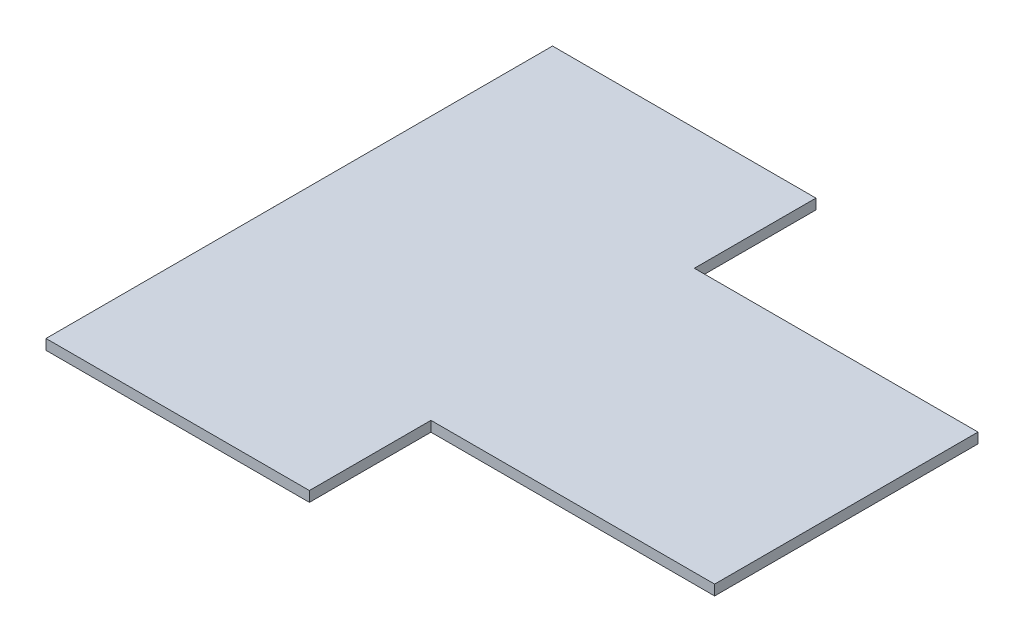
ISO-10303-21;
HEADER;
FILE_DESCRIPTION(('STEP AP214'),'2;1');
FILE_NAME('part.step','',(''),(''),'','','');
FILE_SCHEMA(('AUTOMOTIVE_DESIGN { 1 0 10303 214 1 1 1 1 }'));
ENDSEC;
DATA;
#1=APPLICATION_CONTEXT('core data for automotive mechanical design processes');
#2=APPLICATION_PROTOCOL_DEFINITION('international standard','automotive_design',2000,#1);
#3=PRODUCT_CONTEXT('',#1,'mechanical');
#4=PRODUCT('Part','Part','',(#3));
#5=PRODUCT_RELATED_PRODUCT_CATEGORY('part','',(#4));
#6=PRODUCT_DEFINITION_FORMATION('','',#4);
#7=PRODUCT_DEFINITION_CONTEXT('part definition',#1,'design');
#8=PRODUCT_DEFINITION('design','',#6,#7);
#9=PRODUCT_DEFINITION_SHAPE('','',#8);
#10=(LENGTH_UNIT() NAMED_UNIT(*) SI_UNIT(.MILLI.,.METRE.));
#11=(NAMED_UNIT(*) PLANE_ANGLE_UNIT() SI_UNIT($,.RADIAN.));
#12=(NAMED_UNIT(*) SI_UNIT($,.STERADIAN.) SOLID_ANGLE_UNIT());
#13=UNCERTAINTY_MEASURE_WITH_UNIT(LENGTH_MEASURE(1.E-05),#10,'distance_accuracy_value','');
#14=(GEOMETRIC_REPRESENTATION_CONTEXT(3) GLOBAL_UNCERTAINTY_ASSIGNED_CONTEXT((#13)) GLOBAL_UNIT_ASSIGNED_CONTEXT((#10,
#11,#12)) REPRESENTATION_CONTEXT('',''));
#15=CARTESIAN_POINT('',(0.,0.,0.));
#16=DIRECTION('',(0.,0.,1.));
#17=DIRECTION('',(1.,0.,0.));
#18=AXIS2_PLACEMENT_3D('',#15,#16,#17);
#19=CARTESIAN_POINT('',(-2.50000000000011,1.27,0.));
#20=DIRECTION('',(1.,0.,0.));
#21=DIRECTION('',(0.,0.,-1.));
#22=AXIS2_PLACEMENT_3D('',#19,#20,#21);
#23=PLANE('',#22);
#24=DIRECTION('',(0.,0.,1.));
#25=VECTOR('',#24,1.);
#26=CARTESIAN_POINT('',(-2.50000000000011,-1.27,0.));
#27=LINE('',#26,#25);
#28=CARTESIAN_POINT('',(-2.50000000000005,-1.27,32.5000000000001));
#29=VERTEX_POINT('',#28);
#30=CARTESIAN_POINT('',(-2.50000000000002,-1.27,62.5));
#31=VERTEX_POINT('',#30);
#32=EDGE_CURVE('E131',#29,#31,#27,.T.);
#33=ORIENTED_EDGE('',*,*,#32,.F.);
#34=DIRECTION('',(0.,-1.,0.));
#35=VECTOR('',#34,1.);
#36=CARTESIAN_POINT('',(-2.50000000000005,1.27,32.5000000000001));
#37=LINE('',#36,#35);
#38=CARTESIAN_POINT('',(-2.50000000000005,1.27,32.5000000000001));
#39=VERTEX_POINT('',#38);
#40=EDGE_CURVE('E11',#39,#29,#37,.T.);
#41=ORIENTED_EDGE('',*,*,#40,.F.);
#42=DIRECTION('',(0.,0.,1.));
#43=VECTOR('',#42,1.);
#44=CARTESIAN_POINT('',(-2.50000000000011,1.27,0.));
#45=LINE('',#44,#43);
#46=CARTESIAN_POINT('',(-2.50000000000002,1.27,62.5));
#47=VERTEX_POINT('',#46);
#48=EDGE_CURVE('E149',#39,#47,#45,.T.);
#49=ORIENTED_EDGE('',*,*,#48,.T.);
#50=DIRECTION('',(0.,-1.,0.));
#51=VECTOR('',#50,1.);
#52=CARTESIAN_POINT('',(-2.50000000000002,1.27,62.5));
#53=LINE('',#52,#51);
#54=EDGE_CURVE('E89',#47,#31,#53,.T.);
#55=ORIENTED_EDGE('',*,*,#54,.T.);
#56=EDGE_LOOP('',(#33,#41,#49,#55));
#57=FACE_BOUND('',#56,.T.);
#58=ADVANCED_FACE('F39',(#57),#23,.T.);
#59=CARTESIAN_POINT('',(0.,1.27,32.5000000000001));
#60=DIRECTION('',(0.,0.,1.));
#61=DIRECTION('',(1.,0.,0.));
#62=AXIS2_PLACEMENT_3D('',#59,#60,#61);
#63=PLANE('',#62);
#64=DIRECTION('',(-1.,0.,0.));
#65=VECTOR('',#64,1.);
#66=CARTESIAN_POINT('',(0.,-1.27,32.5000000000001));
#67=LINE('',#66,#65);
#68=CARTESIAN_POINT('',(67.5,-1.27,32.5000000000001));
#69=VERTEX_POINT('',#68);
#70=EDGE_CURVE('E134',#69,#29,#67,.T.);
#71=ORIENTED_EDGE('',*,*,#70,.F.);
#72=DIRECTION('',(0.,-1.,0.));
#73=VECTOR('',#72,1.);
#74=CARTESIAN_POINT('',(67.5,1.27,32.5000000000001));
#75=LINE('',#74,#73);
#76=CARTESIAN_POINT('',(67.5,1.27,32.5000000000001));
#77=VERTEX_POINT('',#76);
#78=EDGE_CURVE('E47',#77,#69,#75,.T.);
#79=ORIENTED_EDGE('',*,*,#78,.F.);
#80=DIRECTION('',(-1.,0.,0.));
#81=VECTOR('',#80,1.);
#82=CARTESIAN_POINT('',(0.,1.27,32.5000000000001));
#83=LINE('',#82,#81);
#84=EDGE_CURVE('E173',#77,#39,#83,.T.);
#85=ORIENTED_EDGE('',*,*,#84,.T.);
#86=ORIENTED_EDGE('',*,*,#40,.T.);
#87=EDGE_LOOP('',(#71,#79,#85,#86));
#88=FACE_BOUND('',#87,.T.);
#89=ADVANCED_FACE('F172',(#88),#63,.T.);
#90=CARTESIAN_POINT('',(67.5,1.27,0.));
#91=DIRECTION('',(-1.,0.,0.));
#92=DIRECTION('',(0.,0.,1.));
#93=AXIS2_PLACEMENT_3D('',#90,#91,#92);
#94=PLANE('',#93);
#95=DIRECTION('',(0.,0.,-1.));
#96=VECTOR('',#95,1.);
#97=CARTESIAN_POINT('',(67.5,-1.27,0.));
#98=LINE('',#97,#96);
#99=CARTESIAN_POINT('',(67.5,-1.27,-32.4999999999999));
#100=VERTEX_POINT('',#99);
#101=EDGE_CURVE('E137',#69,#100,#98,.T.);
#102=ORIENTED_EDGE('',*,*,#101,.T.);
#103=DIRECTION('',(0.,-1.,0.));
#104=VECTOR('',#103,1.);
#105=CARTESIAN_POINT('',(67.5,1.27,-32.4999999999999));
#106=LINE('',#105,#104);
#107=CARTESIAN_POINT('',(67.5,1.27,-32.4999999999999));
#108=VERTEX_POINT('',#107);
#109=EDGE_CURVE('E156',#108,#100,#106,.T.);
#110=ORIENTED_EDGE('',*,*,#109,.F.);
#111=DIRECTION('',(0.,0.,-1.));
#112=VECTOR('',#111,1.);
#113=CARTESIAN_POINT('',(67.5,1.27,0.));
#114=LINE('',#113,#112);
#115=EDGE_CURVE('E163',#77,#108,#114,.T.);
#116=ORIENTED_EDGE('',*,*,#115,.F.);
#117=ORIENTED_EDGE('',*,*,#78,.T.);
#118=EDGE_LOOP('',(#102,#110,#116,#117));
#119=FACE_BOUND('',#118,.T.);
#120=ADVANCED_FACE('F161',(#119),#94,.F.);
#121=CARTESIAN_POINT('',(0.,1.27,-32.4999999999999));
#122=DIRECTION('',(0.,0.,1.));
#123=DIRECTION('',(1.,0.,0.));
#124=AXIS2_PLACEMENT_3D('',#121,#122,#123);
#125=PLANE('',#124);
#126=DIRECTION('',(-1.,0.,0.));
#127=VECTOR('',#126,1.);
#128=CARTESIAN_POINT('',(0.,-1.27,-32.4999999999999));
#129=LINE('',#128,#127);
#130=CARTESIAN_POINT('',(-2.50000000000005,-1.27,-32.4999999999999));
#131=VERTEX_POINT('',#130);
#132=EDGE_CURVE('E139',#100,#131,#129,.T.);
#133=ORIENTED_EDGE('',*,*,#132,.T.);
#134=DIRECTION('',(0.,-1.,0.));
#135=VECTOR('',#134,1.);
#136=CARTESIAN_POINT('',(-2.50000000000005,1.27,-32.4999999999999));
#137=LINE('',#136,#135);
#138=CARTESIAN_POINT('',(-2.50000000000005,1.27,-32.4999999999999));
#139=VERTEX_POINT('',#138);
#140=EDGE_CURVE('E153',#139,#131,#137,.T.);
#141=ORIENTED_EDGE('',*,*,#140,.F.);
#142=DIRECTION('',(-1.,0.,0.));
#143=VECTOR('',#142,1.);
#144=CARTESIAN_POINT('',(0.,1.27,-32.4999999999999));
#145=LINE('',#144,#143);
#146=EDGE_CURVE('E179',#108,#139,#145,.T.);
#147=ORIENTED_EDGE('',*,*,#146,.F.);
#148=ORIENTED_EDGE('',*,*,#109,.T.);
#149=EDGE_LOOP('',(#133,#141,#147,#148));
#150=FACE_BOUND('',#149,.T.);
#151=ADVANCED_FACE('F183',(#150),#125,.F.);
#152=CARTESIAN_POINT('',(-2.50000000000011,1.27,0.));
#153=DIRECTION('',(-1.,0.,0.));
#154=DIRECTION('',(0.,0.,1.));
#155=AXIS2_PLACEMENT_3D('',#152,#153,#154);
#156=PLANE('',#155);
#157=DIRECTION('',(0.,0.,-1.));
#158=VECTOR('',#157,1.);
#159=CARTESIAN_POINT('',(-2.50000000000011,-1.27,0.));
#160=LINE('',#159,#158);
#161=CARTESIAN_POINT('',(-2.50000000000002,-1.27,-62.5));
#162=VERTEX_POINT('',#161);
#163=EDGE_CURVE('E141',#131,#162,#160,.T.);
#164=ORIENTED_EDGE('',*,*,#163,.T.);
#165=DIRECTION('',(0.,-1.,0.));
#166=VECTOR('',#165,1.);
#167=CARTESIAN_POINT('',(-2.50000000000002,1.27,-62.5));
#168=LINE('',#167,#166);
#169=CARTESIAN_POINT('',(-2.50000000000002,1.27,-62.5));
#170=VERTEX_POINT('',#169);
#171=EDGE_CURVE('E118',#170,#162,#168,.T.);
#172=ORIENTED_EDGE('',*,*,#171,.F.);
#173=DIRECTION('',(0.,0.,-1.));
#174=VECTOR('',#173,1.);
#175=CARTESIAN_POINT('',(-2.50000000000011,1.27,0.));
#176=LINE('',#175,#174);
#177=EDGE_CURVE('E123',#139,#170,#176,.T.);
#178=ORIENTED_EDGE('',*,*,#177,.F.);
#179=ORIENTED_EDGE('',*,*,#140,.T.);
#180=EDGE_LOOP('',(#164,#172,#178,#179));
#181=FACE_BOUND('',#180,.T.);
#182=ADVANCED_FACE('F185',(#181),#156,.F.);
#183=CARTESIAN_POINT('',(0.,1.27,-62.5));
#184=DIRECTION('',(0.,0.,-1.));
#185=DIRECTION('',(-1.,0.,0.));
#186=AXIS2_PLACEMENT_3D('',#183,#184,#185);
#187=PLANE('',#186);
#188=DIRECTION('',(1.,0.,0.));
#189=VECTOR('',#188,1.);
#190=CARTESIAN_POINT('',(0.,-1.27,-62.5));
#191=LINE('',#190,#189);
#192=CARTESIAN_POINT('',(-67.5,-1.27,-62.5));
#193=VERTEX_POINT('',#192);
#194=EDGE_CURVE('E113',#193,#162,#191,.T.);
#195=ORIENTED_EDGE('',*,*,#194,.F.);
#196=DIRECTION('',(0.,-1.,0.));
#197=VECTOR('',#196,1.);
#198=CARTESIAN_POINT('',(-67.5,1.27,-62.5));
#199=LINE('',#198,#197);
#200=CARTESIAN_POINT('',(-67.5,1.27,-62.5));
#201=VERTEX_POINT('',#200);
#202=EDGE_CURVE('E108',#201,#193,#199,.T.);
#203=ORIENTED_EDGE('',*,*,#202,.F.);
#204=DIRECTION('',(1.,0.,0.));
#205=VECTOR('',#204,1.);
#206=CARTESIAN_POINT('',(0.,1.27,-62.5));
#207=LINE('',#206,#205);
#208=EDGE_CURVE('E111',#201,#170,#207,.T.);
#209=ORIENTED_EDGE('',*,*,#208,.T.);
#210=ORIENTED_EDGE('',*,*,#171,.T.);
#211=EDGE_LOOP('',(#195,#203,#209,#210));
#212=FACE_BOUND('',#211,.T.);
#213=ADVANCED_FACE('F110',(#212),#187,.T.);
#214=CARTESIAN_POINT('',(-67.5,1.27,0.));
#215=DIRECTION('',(-1.,0.,0.));
#216=DIRECTION('',(0.,0.,1.));
#217=AXIS2_PLACEMENT_3D('',#214,#215,#216);
#218=PLANE('',#217);
#219=DIRECTION('',(0.,0.,-1.));
#220=VECTOR('',#219,1.);
#221=CARTESIAN_POINT('',(-67.5,-1.27,0.));
#222=LINE('',#221,#220);
#223=CARTESIAN_POINT('',(-67.5,-1.27,62.5));
#224=VERTEX_POINT('',#223);
#225=EDGE_CURVE('E145',#224,#193,#222,.T.);
#226=ORIENTED_EDGE('',*,*,#225,.F.);
#227=DIRECTION('',(0.,-1.,0.));
#228=VECTOR('',#227,1.);
#229=CARTESIAN_POINT('',(-67.5,1.27,62.5));
#230=LINE('',#229,#228);
#231=CARTESIAN_POINT('',(-67.5,1.27,62.5));
#232=VERTEX_POINT('',#231);
#233=EDGE_CURVE('E82',#232,#224,#230,.T.);
#234=ORIENTED_EDGE('',*,*,#233,.F.);
#235=DIRECTION('',(0.,0.,-1.));
#236=VECTOR('',#235,1.);
#237=CARTESIAN_POINT('',(-67.5,1.27,0.));
#238=LINE('',#237,#236);
#239=EDGE_CURVE('E121',#232,#201,#238,.T.);
#240=ORIENTED_EDGE('',*,*,#239,.T.);
#241=ORIENTED_EDGE('',*,*,#202,.T.);
#242=EDGE_LOOP('',(#226,#234,#240,#241));
#243=FACE_BOUND('',#242,.T.);
#244=ADVANCED_FACE('F126',(#243),#218,.T.);
#245=CARTESIAN_POINT('',(0.,1.27,62.5));
#246=DIRECTION('',(0.,0.,-1.));
#247=DIRECTION('',(-1.,0.,0.));
#248=AXIS2_PLACEMENT_3D('',#245,#246,#247);
#249=PLANE('',#248);
#250=DIRECTION('',(1.,0.,0.));
#251=VECTOR('',#250,1.);
#252=CARTESIAN_POINT('',(0.,-1.27,62.5));
#253=LINE('',#252,#251);
#254=EDGE_CURVE('E147',#224,#31,#253,.T.);
#255=ORIENTED_EDGE('',*,*,#254,.T.);
#256=ORIENTED_EDGE('',*,*,#54,.F.);
#257=DIRECTION('',(1.,0.,0.));
#258=VECTOR('',#257,1.);
#259=CARTESIAN_POINT('',(0.,1.27,62.5));
#260=LINE('',#259,#258);
#261=EDGE_CURVE('E55',#232,#47,#260,.T.);
#262=ORIENTED_EDGE('',*,*,#261,.F.);
#263=ORIENTED_EDGE('',*,*,#233,.T.);
#264=EDGE_LOOP('',(#255,#256,#262,#263));
#265=FACE_BOUND('',#264,.T.);
#266=ADVANCED_FACE('F174',(#265),#249,.F.);
#267=CARTESIAN_POINT('',(0.,1.27,0.));
#268=DIRECTION('',(0.,1.,0.));
#269=DIRECTION('',(0.,0.,1.));
#270=AXIS2_PLACEMENT_3D('',#267,#268,#269);
#271=PLANE('',#270);
#272=ORIENTED_EDGE('',*,*,#48,.F.);
#273=ORIENTED_EDGE('',*,*,#84,.F.);
#274=ORIENTED_EDGE('',*,*,#115,.T.);
#275=ORIENTED_EDGE('',*,*,#146,.T.);
#276=ORIENTED_EDGE('',*,*,#177,.T.);
#277=ORIENTED_EDGE('',*,*,#208,.F.);
#278=ORIENTED_EDGE('',*,*,#239,.F.);
#279=ORIENTED_EDGE('',*,*,#261,.T.);
#280=EDGE_LOOP('',(#272,#273,#274,#275,#276,#277,#278,#279));
#281=FACE_BOUND('',#280,.T.);
#282=ADVANCED_FACE('F120',(#281),#271,.T.);
#283=CARTESIAN_POINT('',(0.,-1.27,0.));
#284=DIRECTION('',(0.,1.,0.));
#285=DIRECTION('',(0.,0.,1.));
#286=AXIS2_PLACEMENT_3D('',#283,#284,#285);
#287=PLANE('',#286);
#288=ORIENTED_EDGE('',*,*,#32,.T.);
#289=ORIENTED_EDGE('',*,*,#254,.F.);
#290=ORIENTED_EDGE('',*,*,#225,.T.);
#291=ORIENTED_EDGE('',*,*,#194,.T.);
#292=ORIENTED_EDGE('',*,*,#163,.F.);
#293=ORIENTED_EDGE('',*,*,#132,.F.);
#294=ORIENTED_EDGE('',*,*,#101,.F.);
#295=ORIENTED_EDGE('',*,*,#70,.T.);
#296=EDGE_LOOP('',(#288,#289,#290,#291,#292,#293,#294,#295));
#297=FACE_BOUND('',#296,.T.);
#298=ADVANCED_FACE('F170',(#297),#287,.F.);
#299=CLOSED_SHELL('',(#58,#89,#120,#151,#182,#213,#244,#266,#282,#298));
#300=MANIFOLD_SOLID_BREP('B2',#299);
#301=ADVANCED_BREP_SHAPE_REPRESENTATION('',(#18,#300),#14);
#302=SHAPE_DEFINITION_REPRESENTATION(#9,#301);
ENDSEC;
END-ISO-10303-21;
